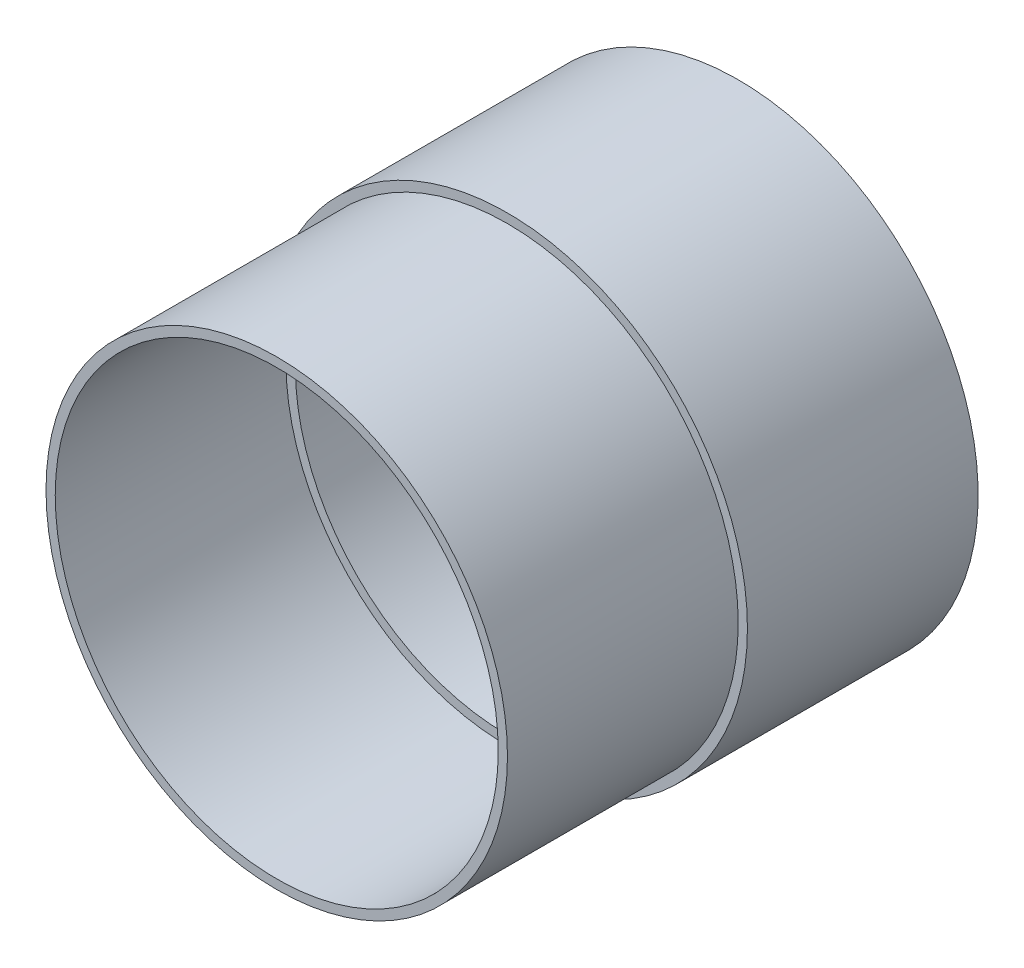
ISO-10303-21;
HEADER;
FILE_DESCRIPTION(('STEP AP214'),'2;1');
FILE_NAME('part.step','',(''),(''),'','','');
FILE_SCHEMA(('AUTOMOTIVE_DESIGN { 1 0 10303 214 1 1 1 1 }'));
ENDSEC;
DATA;
#1=APPLICATION_CONTEXT('core data for automotive mechanical design processes');
#2=APPLICATION_PROTOCOL_DEFINITION('international standard','automotive_design',2000,#1);
#3=PRODUCT_CONTEXT('',#1,'mechanical');
#4=PRODUCT('Part','Part','',(#3));
#5=PRODUCT_RELATED_PRODUCT_CATEGORY('part','',(#4));
#6=PRODUCT_DEFINITION_FORMATION('','',#4);
#7=PRODUCT_DEFINITION_CONTEXT('part definition',#1,'design');
#8=PRODUCT_DEFINITION('design','',#6,#7);
#9=PRODUCT_DEFINITION_SHAPE('','',#8);
#10=(LENGTH_UNIT() NAMED_UNIT(*) SI_UNIT(.MILLI.,.METRE.));
#11=(NAMED_UNIT(*) PLANE_ANGLE_UNIT() SI_UNIT($,.RADIAN.));
#12=(NAMED_UNIT(*) SI_UNIT($,.STERADIAN.) SOLID_ANGLE_UNIT());
#13=UNCERTAINTY_MEASURE_WITH_UNIT(LENGTH_MEASURE(1.E-05),#10,'distance_accuracy_value','');
#14=(GEOMETRIC_REPRESENTATION_CONTEXT(3) GLOBAL_UNCERTAINTY_ASSIGNED_CONTEXT((#13)) GLOBAL_UNIT_ASSIGNED_CONTEXT((#10,
#11,#12)) REPRESENTATION_CONTEXT('',''));
#15=CARTESIAN_POINT('',(0.,0.,0.));
#16=DIRECTION('',(0.,0.,1.));
#17=DIRECTION('',(1.,0.,0.));
#18=AXIS2_PLACEMENT_3D('',#15,#16,#17);
#19=CARTESIAN_POINT('',(-84.0182648401827,0.,-40.));
#20=DIRECTION('',(0.,0.,-1.));
#21=DIRECTION('',(-1.,0.,0.));
#22=AXIS2_PLACEMENT_3D('',#19,#20,#21);
#23=CYLINDRICAL_SURFACE('',#22,52.);
#24=CARTESIAN_POINT('',(-84.0182648401827,0.,0.));
#25=DIRECTION('',(0.,0.,1.));
#26=DIRECTION('',(1.,0.,0.));
#27=AXIS2_PLACEMENT_3D('',#24,#25,#26);
#28=CIRCLE('',#27,52.);
#29=CARTESIAN_POINT('',(-32.0182648401827,0.,0.));
#30=VERTEX_POINT('',#29);
#31=EDGE_CURVE('E51',#30,#30,#28,.T.);
#32=ORIENTED_EDGE('',*,*,#31,.F.);
#33=EDGE_LOOP('',(#32));
#34=FACE_BOUND('',#33,.T.);
#35=CARTESIAN_POINT('',(-84.0182648401827,0.,-50.));
#36=DIRECTION('',(0.,0.,-1.));
#37=DIRECTION('',(-1.,0.,0.));
#38=AXIS2_PLACEMENT_3D('',#35,#36,#37);
#39=CIRCLE('',#38,52.);
#40=CARTESIAN_POINT('',(-136.018264840183,0.,-50.));
#41=VERTEX_POINT('',#40);
#42=EDGE_CURVE('E39',#41,#41,#39,.T.);
#43=ORIENTED_EDGE('',*,*,#42,.F.);
#44=EDGE_LOOP('',(#43));
#45=FACE_BOUND('',#44,.T.);
#46=ADVANCED_FACE('F31',(#34,#45),#23,.T.);
#47=CARTESIAN_POINT('',(-84.0182648401827,0.,-50.));
#48=DIRECTION('',(0.,0.,1.));
#49=DIRECTION('',(1.,0.,0.));
#50=AXIS2_PLACEMENT_3D('',#47,#48,#49);
#51=PLANE('',#50);
#52=ORIENTED_EDGE('',*,*,#42,.T.);
#53=EDGE_LOOP('',(#52));
#54=FACE_BOUND('',#53,.T.);
#55=ADVANCED_FACE('F92',(#54),#51,.F.);
#56=CARTESIAN_POINT('',(-84.0182648401827,0.,0.));
#57=DIRECTION('',(0.,0.,1.));
#58=DIRECTION('',(1.,0.,0.));
#59=AXIS2_PLACEMENT_3D('',#56,#57,#58);
#60=PLANE('',#59);
#61=ORIENTED_EDGE('',*,*,#31,.T.);
#62=EDGE_LOOP('',(#61));
#63=FACE_BOUND('',#62,.T.);
#64=CARTESIAN_POINT('',(-84.0182648401827,0.,0.));
#65=DIRECTION('',(0.,0.,1.));
#66=DIRECTION('',(1.,0.,0.));
#67=AXIS2_PLACEMENT_3D('',#64,#65,#66);
#68=CIRCLE('',#67,50.);
#69=CARTESIAN_POINT('',(-34.0182648401827,0.,0.));
#70=VERTEX_POINT('',#69);
#71=EDGE_CURVE('E48',#70,#70,#68,.T.);
#72=ORIENTED_EDGE('',*,*,#71,.F.);
#73=EDGE_LOOP('',(#72));
#74=FACE_BOUND('',#73,.T.);
#75=ADVANCED_FACE('F74',(#63,#74),#60,.T.);
#76=CARTESIAN_POINT('',(-84.0182648401827,0.,50.));
#77=DIRECTION('',(0.,0.,-1.));
#78=DIRECTION('',(-1.,0.,0.));
#79=AXIS2_PLACEMENT_3D('',#76,#77,#78);
#80=CYLINDRICAL_SURFACE('',#79,50.);
#81=ORIENTED_EDGE('',*,*,#71,.T.);
#82=EDGE_LOOP('',(#81));
#83=FACE_BOUND('',#82,.T.);
#84=CARTESIAN_POINT('',(-84.0182648401827,0.,50.));
#85=DIRECTION('',(0.,0.,1.));
#86=DIRECTION('',(1.,0.,0.));
#87=AXIS2_PLACEMENT_3D('',#84,#85,#86);
#88=CIRCLE('',#87,50.);
#89=CARTESIAN_POINT('',(-34.0182648401827,0.,50.));
#90=VERTEX_POINT('',#89);
#91=EDGE_CURVE('E10',#90,#90,#88,.T.);
#92=ORIENTED_EDGE('',*,*,#91,.F.);
#93=EDGE_LOOP('',(#92));
#94=FACE_BOUND('',#93,.T.);
#95=ADVANCED_FACE('F33',(#83,#94),#80,.T.);
#96=CARTESIAN_POINT('',(-84.0182648401827,0.,50.));
#97=DIRECTION('',(0.,0.,1.));
#98=DIRECTION('',(1.,0.,0.));
#99=AXIS2_PLACEMENT_3D('',#96,#97,#98);
#100=PLANE('',#99);
#101=CARTESIAN_POINT('',(-84.0182648401827,0.,50.));
#102=DIRECTION('',(0.,0.,1.));
#103=DIRECTION('',(1.,0.,0.));
#104=AXIS2_PLACEMENT_3D('',#101,#102,#103);
#105=CIRCLE('',#104,48.);
#106=CARTESIAN_POINT('',(-36.0182648401826,0.,50.));
#107=VERTEX_POINT('',#106);
#108=EDGE_CURVE('E43',#107,#107,#105,.T.);
#109=ORIENTED_EDGE('',*,*,#108,.F.);
#110=EDGE_LOOP('',(#109));
#111=FACE_BOUND('',#110,.T.);
#112=ORIENTED_EDGE('',*,*,#91,.T.);
#113=EDGE_LOOP('',(#112));
#114=FACE_BOUND('',#113,.T.);
#115=ADVANCED_FACE('F80',(#111,#114),#100,.T.);
#116=CARTESIAN_POINT('',(-84.0182648401827,0.,-47.));
#117=DIRECTION('',(0.,0.,1.));
#118=DIRECTION('',(1.,0.,0.));
#119=AXIS2_PLACEMENT_3D('',#116,#117,#118);
#120=CYLINDRICAL_SURFACE('',#119,48.);
#121=CARTESIAN_POINT('',(-84.0182648401827,0.,0.));
#122=DIRECTION('',(0.,0.,1.));
#123=DIRECTION('',(1.,0.,0.));
#124=AXIS2_PLACEMENT_3D('',#121,#122,#123);
#125=CIRCLE('',#124,48.);
#126=CARTESIAN_POINT('',(-36.0182648401826,0.,0.));
#127=VERTEX_POINT('',#126);
#128=EDGE_CURVE('E35',#127,#127,#125,.F.);
#129=ORIENTED_EDGE('',*,*,#128,.T.);
#130=EDGE_LOOP('',(#129));
#131=FACE_BOUND('',#130,.T.);
#132=ORIENTED_EDGE('',*,*,#108,.T.);
#133=EDGE_LOOP('',(#132));
#134=FACE_BOUND('',#133,.T.);
#135=ADVANCED_FACE('F72',(#131,#134),#120,.F.);
#136=CARTESIAN_POINT('',(-84.0182648401827,0.,0.));
#137=DIRECTION('',(0.,0.,1.));
#138=DIRECTION('',(1.,0.,0.));
#139=AXIS2_PLACEMENT_3D('',#136,#137,#138);
#140=CIRCLE('',#139,45.9662177115192);
#141=CARTESIAN_POINT('',(-38.0520471286634,0.,0.));
#142=VERTEX_POINT('',#141);
#143=EDGE_CURVE('E55',#142,#142,#140,.T.);
#144=ORIENTED_EDGE('',*,*,#143,.F.);
#145=EDGE_LOOP('',(#144));
#146=FACE_BOUND('',#145,.T.);
#147=ORIENTED_EDGE('',*,*,#128,.F.);
#148=EDGE_LOOP('',(#147));
#149=FACE_BOUND('',#148,.T.);
#150=ADVANCED_FACE('F66',(#146,#149),#60,.T.);
#151=CARTESIAN_POINT('',(-84.0182648401827,0.,-47.));
#152=DIRECTION('',(0.,0.,1.));
#153=DIRECTION('',(1.,0.,0.));
#154=AXIS2_PLACEMENT_3D('',#151,#152,#153);
#155=CYLINDRICAL_SURFACE('',#154,45.9662177115192);
#156=CARTESIAN_POINT('',(-84.0182648401827,0.,-47.));
#157=DIRECTION('',(0.,0.,1.));
#158=DIRECTION('',(1.,0.,0.));
#159=AXIS2_PLACEMENT_3D('',#156,#157,#158);
#160=CIRCLE('',#159,45.9662177115192);
#161=CARTESIAN_POINT('',(-38.0520471286634,0.,-47.));
#162=VERTEX_POINT('',#161);
#163=EDGE_CURVE('E54',#162,#162,#160,.T.);
#164=ORIENTED_EDGE('',*,*,#163,.F.);
#165=EDGE_LOOP('',(#164));
#166=FACE_BOUND('',#165,.T.);
#167=ORIENTED_EDGE('',*,*,#143,.T.);
#168=EDGE_LOOP('',(#167));
#169=FACE_BOUND('',#168,.T.);
#170=ADVANCED_FACE('F63',(#166,#169),#155,.F.);
#171=CARTESIAN_POINT('',(-84.0182648401827,0.,-47.));
#172=DIRECTION('',(0.,0.,1.));
#173=DIRECTION('',(1.,0.,0.));
#174=AXIS2_PLACEMENT_3D('',#171,#172,#173);
#175=PLANE('',#174);
#176=ORIENTED_EDGE('',*,*,#163,.T.);
#177=EDGE_LOOP('',(#176));
#178=FACE_BOUND('',#177,.T.);
#179=ADVANCED_FACE('F61',(#178),#175,.T.);
#180=CLOSED_SHELL('',(#46,#55,#75,#95,#115,#135,#150,#170,#179));
#181=MANIFOLD_SOLID_BREP('B2',#180);
#182=ADVANCED_BREP_SHAPE_REPRESENTATION('',(#18,#181),#14);
#183=SHAPE_DEFINITION_REPRESENTATION(#9,#182);
ENDSEC;
END-ISO-10303-21;
